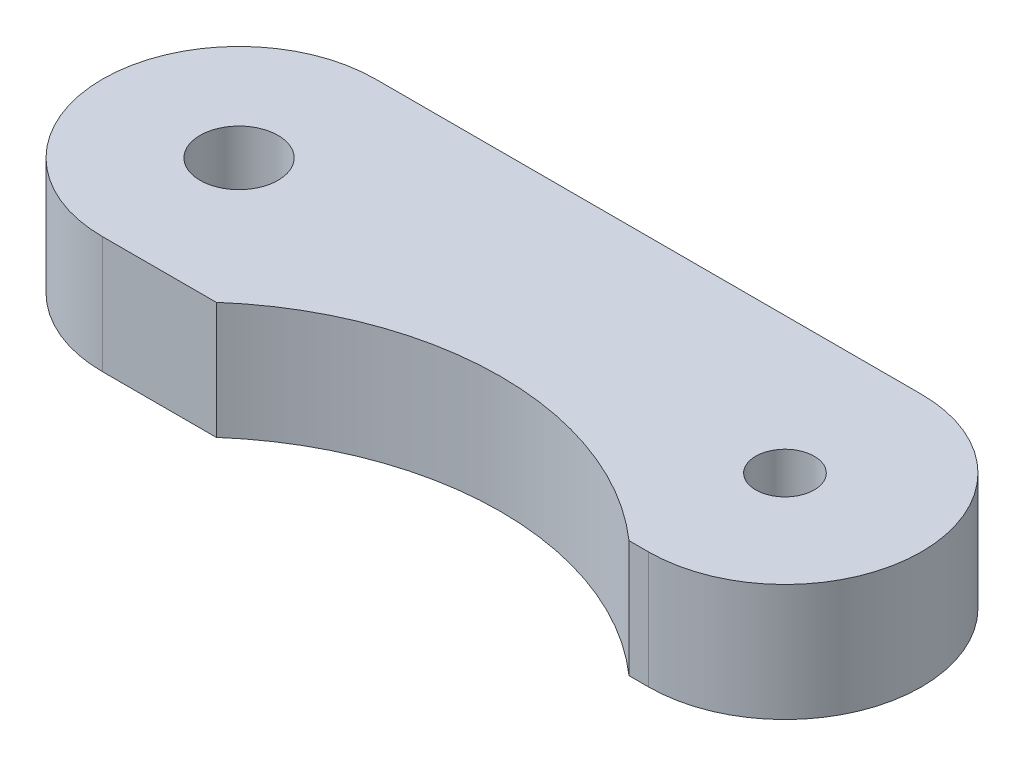
ISO-10303-21;
HEADER;
FILE_DESCRIPTION(('STEP AP214'),'2;1');
FILE_NAME('part.step','',(''),(''),'','','');
FILE_SCHEMA(('AUTOMOTIVE_DESIGN { 1 0 10303 214 1 1 1 1 }'));
ENDSEC;
DATA;
#1=APPLICATION_CONTEXT('core data for automotive mechanical design processes');
#2=APPLICATION_PROTOCOL_DEFINITION('international standard','automotive_design',2000,#1);
#3=PRODUCT_CONTEXT('',#1,'mechanical');
#4=PRODUCT('Part','Part','',(#3));
#5=PRODUCT_RELATED_PRODUCT_CATEGORY('part','',(#4));
#6=PRODUCT_DEFINITION_FORMATION('','',#4);
#7=PRODUCT_DEFINITION_CONTEXT('part definition',#1,'design');
#8=PRODUCT_DEFINITION('design','',#6,#7);
#9=PRODUCT_DEFINITION_SHAPE('','',#8);
#10=(LENGTH_UNIT() NAMED_UNIT(*) SI_UNIT(.MILLI.,.METRE.));
#11=(NAMED_UNIT(*) PLANE_ANGLE_UNIT() SI_UNIT($,.RADIAN.));
#12=(NAMED_UNIT(*) SI_UNIT($,.STERADIAN.) SOLID_ANGLE_UNIT());
#13=UNCERTAINTY_MEASURE_WITH_UNIT(LENGTH_MEASURE(1.E-05),#10,'distance_accuracy_value','');
#14=(GEOMETRIC_REPRESENTATION_CONTEXT(3) GLOBAL_UNCERTAINTY_ASSIGNED_CONTEXT((#13)) GLOBAL_UNIT_ASSIGNED_CONTEXT((#10,
#11,#12)) REPRESENTATION_CONTEXT('',''));
#15=CARTESIAN_POINT('',(0.,0.,0.));
#16=DIRECTION('',(0.,0.,1.));
#17=DIRECTION('',(1.,0.,0.));
#18=AXIS2_PLACEMENT_3D('',#15,#16,#17);
#19=CARTESIAN_POINT('',(0.,3.,3.5));
#20=DIRECTION('',(0.,0.,-1.));
#21=DIRECTION('',(-1.,0.,0.));
#22=AXIS2_PLACEMENT_3D('',#19,#20,#21);
#23=PLANE('',#22);
#24=DIRECTION('',(1.,0.,0.));
#25=VECTOR('',#24,1.);
#26=CARTESIAN_POINT('',(0.,0.,3.5));
#27=LINE('',#26,#25);
#28=CARTESIAN_POINT('',(0.,0.,3.5));
#29=VERTEX_POINT('',#28);
#30=CARTESIAN_POINT('',(2.91699475574164,0.,3.5));
#31=VERTEX_POINT('',#30);
#32=EDGE_CURVE('E107',#29,#31,#27,.T.);
#33=ORIENTED_EDGE('',*,*,#32,.T.);
#34=DIRECTION('',(0.,1.,0.));
#35=VECTOR('',#34,1.);
#36=CARTESIAN_POINT('',(2.91699475574164,-7.,3.5));
#37=LINE('',#36,#35);
#38=CARTESIAN_POINT('',(2.91699475574164,3.,3.5));
#39=VERTEX_POINT('',#38);
#40=EDGE_CURVE('E11',#31,#39,#37,.T.);
#41=ORIENTED_EDGE('',*,*,#40,.T.);
#42=DIRECTION('',(1.,0.,0.));
#43=VECTOR('',#42,1.);
#44=CARTESIAN_POINT('',(0.,3.,3.5));
#45=LINE('',#44,#43);
#46=CARTESIAN_POINT('',(0.,3.,3.5));
#47=VERTEX_POINT('',#46);
#48=EDGE_CURVE('E92',#47,#39,#45,.T.);
#49=ORIENTED_EDGE('',*,*,#48,.F.);
#50=DIRECTION('',(0.,-1.,0.));
#51=VECTOR('',#50,1.);
#52=CARTESIAN_POINT('',(0.,3.,3.5));
#53=LINE('',#52,#51);
#54=EDGE_CURVE('E148',#47,#29,#53,.T.);
#55=ORIENTED_EDGE('',*,*,#54,.T.);
#56=EDGE_LOOP('',(#33,#41,#49,#55));
#57=FACE_BOUND('',#56,.T.);
#58=ADVANCED_FACE('F39',(#57),#23,.F.);
#59=CARTESIAN_POINT('',(0.,3.,0.));
#60=DIRECTION('',(0.,1.,0.));
#61=DIRECTION('',(0.,0.,1.));
#62=AXIS2_PLACEMENT_3D('',#59,#60,#61);
#63=PLANE('',#62);
#64=CARTESIAN_POINT('',(8.20849737787082,3.,9.5));
#65=DIRECTION('',(0.,1.,0.));
#66=DIRECTION('',(0.,0.,-1.));
#67=AXIS2_PLACEMENT_3D('',#64,#65,#66);
#68=CIRCLE('',#67,8.);
#69=CARTESIAN_POINT('',(13.5,3.,3.5));
#70=VERTEX_POINT('',#69);
#71=EDGE_CURVE('E101',#70,#39,#68,.T.);
#72=ORIENTED_EDGE('',*,*,#71,.F.);
#73=CARTESIAN_POINT('',(14.,3.,3.5));
#74=VERTEX_POINT('',#73);
#75=EDGE_CURVE('E115',#70,#74,#45,.T.);
#76=ORIENTED_EDGE('',*,*,#75,.T.);
#77=CARTESIAN_POINT('',(14.,3.,0.));
#78=DIRECTION('',(0.,1.,0.));
#79=DIRECTION('',(0.,0.,1.));
#80=AXIS2_PLACEMENT_3D('',#77,#78,#79);
#81=CIRCLE('',#80,3.5);
#82=CARTESIAN_POINT('',(14.,3.,-3.5));
#83=VERTEX_POINT('',#82);
#84=EDGE_CURVE('E114',#74,#83,#81,.T.);
#85=ORIENTED_EDGE('',*,*,#84,.T.);
#86=DIRECTION('',(-1.,0.,0.));
#87=VECTOR('',#86,1.);
#88=CARTESIAN_POINT('',(0.,3.,-3.5));
#89=LINE('',#88,#87);
#90=CARTESIAN_POINT('',(0.,3.,-3.5));
#91=VERTEX_POINT('',#90);
#92=EDGE_CURVE('E64',#83,#91,#89,.T.);
#93=ORIENTED_EDGE('',*,*,#92,.T.);
#94=CARTESIAN_POINT('',(0.,3.,0.));
#95=DIRECTION('',(0.,1.,0.));
#96=DIRECTION('',(0.,0.,1.));
#97=AXIS2_PLACEMENT_3D('',#94,#95,#96);
#98=CIRCLE('',#97,3.5);
#99=EDGE_CURVE('E111',#91,#47,#98,.T.);
#100=ORIENTED_EDGE('',*,*,#99,.T.);
#101=ORIENTED_EDGE('',*,*,#48,.T.);
#102=EDGE_LOOP('',(#72,#76,#85,#93,#100,#101));
#103=FACE_BOUND('',#102,.T.);
#104=CARTESIAN_POINT('',(14.,3.,0.));
#105=DIRECTION('',(0.,1.,0.));
#106=DIRECTION('',(0.,0.,1.));
#107=AXIS2_PLACEMENT_3D('',#104,#105,#106);
#108=CIRCLE('',#107,0.75);
#109=CARTESIAN_POINT('',(14.,3.,0.75));
#110=VERTEX_POINT('',#109);
#111=EDGE_CURVE('E131',#110,#110,#108,.T.);
#112=ORIENTED_EDGE('',*,*,#111,.F.);
#113=EDGE_LOOP('',(#112));
#114=FACE_BOUND('',#113,.T.);
#115=CARTESIAN_POINT('',(0.,3.,0.));
#116=DIRECTION('',(0.,1.,0.));
#117=DIRECTION('',(0.,0.,1.));
#118=AXIS2_PLACEMENT_3D('',#115,#116,#117);
#119=CIRCLE('',#118,1.);
#120=CARTESIAN_POINT('',(0.,3.,1.));
#121=VERTEX_POINT('',#120);
#122=EDGE_CURVE('E167',#121,#121,#119,.T.);
#123=ORIENTED_EDGE('',*,*,#122,.F.);
#124=EDGE_LOOP('',(#123));
#125=FACE_BOUND('',#124,.T.);
#126=ADVANCED_FACE('F108',(#103,#114,#125),#63,.T.);
#127=CARTESIAN_POINT('',(0.,0.,0.));
#128=DIRECTION('',(0.,1.,0.));
#129=DIRECTION('',(0.,0.,1.));
#130=AXIS2_PLACEMENT_3D('',#127,#128,#129);
#131=PLANE('',#130);
#132=CARTESIAN_POINT('',(13.5,0.,3.5));
#133=VERTEX_POINT('',#132);
#134=CARTESIAN_POINT('',(14.,0.,3.5));
#135=VERTEX_POINT('',#134);
#136=EDGE_CURVE('E130',#133,#135,#27,.T.);
#137=ORIENTED_EDGE('',*,*,#136,.F.);
#138=CARTESIAN_POINT('',(8.20849737787082,0.,9.5));
#139=DIRECTION('',(0.,1.,0.));
#140=DIRECTION('',(0.,0.,1.));
#141=AXIS2_PLACEMENT_3D('',#138,#139,#140);
#142=CIRCLE('',#141,8.);
#143=EDGE_CURVE('E55',#133,#31,#142,.T.);
#144=ORIENTED_EDGE('',*,*,#143,.T.);
#145=ORIENTED_EDGE('',*,*,#32,.F.);
#146=CARTESIAN_POINT('',(0.,0.,0.));
#147=DIRECTION('',(0.,1.,0.));
#148=DIRECTION('',(0.,0.,1.));
#149=AXIS2_PLACEMENT_3D('',#146,#147,#148);
#150=CIRCLE('',#149,3.5);
#151=CARTESIAN_POINT('',(0.,0.,-3.5));
#152=VERTEX_POINT('',#151);
#153=EDGE_CURVE('E126',#152,#29,#150,.T.);
#154=ORIENTED_EDGE('',*,*,#153,.F.);
#155=DIRECTION('',(-1.,0.,0.));
#156=VECTOR('',#155,1.);
#157=CARTESIAN_POINT('',(0.,0.,-3.5));
#158=LINE('',#157,#156);
#159=CARTESIAN_POINT('',(14.,0.,-3.5));
#160=VERTEX_POINT('',#159);
#161=EDGE_CURVE('E85',#160,#152,#158,.T.);
#162=ORIENTED_EDGE('',*,*,#161,.F.);
#163=CARTESIAN_POINT('',(14.,0.,0.));
#164=DIRECTION('',(0.,1.,0.));
#165=DIRECTION('',(0.,0.,1.));
#166=AXIS2_PLACEMENT_3D('',#163,#164,#165);
#167=CIRCLE('',#166,3.5);
#168=EDGE_CURVE('E134',#135,#160,#167,.T.);
#169=ORIENTED_EDGE('',*,*,#168,.F.);
#170=EDGE_LOOP('',(#137,#144,#145,#154,#162,#169));
#171=FACE_BOUND('',#170,.T.);
#172=CARTESIAN_POINT('',(14.,0.,0.));
#173=DIRECTION('',(0.,1.,0.));
#174=DIRECTION('',(0.,0.,1.));
#175=AXIS2_PLACEMENT_3D('',#172,#173,#174);
#176=CIRCLE('',#175,0.75);
#177=CARTESIAN_POINT('',(14.,0.,0.75));
#178=VERTEX_POINT('',#177);
#179=EDGE_CURVE('E163',#178,#178,#176,.T.);
#180=ORIENTED_EDGE('',*,*,#179,.T.);
#181=EDGE_LOOP('',(#180));
#182=FACE_BOUND('',#181,.T.);
#183=CARTESIAN_POINT('',(0.,0.,0.));
#184=DIRECTION('',(0.,1.,0.));
#185=DIRECTION('',(0.,0.,1.));
#186=AXIS2_PLACEMENT_3D('',#183,#184,#185);
#187=CIRCLE('',#186,1.);
#188=CARTESIAN_POINT('',(0.,0.,1.));
#189=VERTEX_POINT('',#188);
#190=EDGE_CURVE('E170',#189,#189,#187,.T.);
#191=ORIENTED_EDGE('',*,*,#190,.T.);
#192=EDGE_LOOP('',(#191));
#193=FACE_BOUND('',#192,.T.);
#194=ADVANCED_FACE('F157',(#171,#182,#193),#131,.F.);
#195=CARTESIAN_POINT('',(0.,3.,0.));
#196=DIRECTION('',(0.,-1.,0.));
#197=DIRECTION('',(0.,0.,-1.));
#198=AXIS2_PLACEMENT_3D('',#195,#196,#197);
#199=CYLINDRICAL_SURFACE('',#198,3.5);
#200=ORIENTED_EDGE('',*,*,#153,.T.);
#201=ORIENTED_EDGE('',*,*,#54,.F.);
#202=ORIENTED_EDGE('',*,*,#99,.F.);
#203=DIRECTION('',(0.,-1.,0.));
#204=VECTOR('',#203,1.);
#205=CARTESIAN_POINT('',(0.,3.,-3.5));
#206=LINE('',#205,#204);
#207=EDGE_CURVE('E125',#91,#152,#206,.T.);
#208=ORIENTED_EDGE('',*,*,#207,.T.);
#209=EDGE_LOOP('',(#200,#201,#202,#208));
#210=FACE_BOUND('',#209,.T.);
#211=ADVANCED_FACE('F41',(#210),#199,.T.);
#212=ORIENTED_EDGE('',*,*,#75,.F.);
#213=DIRECTION('',(0.,1.,0.));
#214=VECTOR('',#213,1.);
#215=CARTESIAN_POINT('',(13.5,-7.,3.5));
#216=LINE('',#215,#214);
#217=EDGE_CURVE('E48',#70,#133,#216,.F.);
#218=ORIENTED_EDGE('',*,*,#217,.T.);
#219=ORIENTED_EDGE('',*,*,#136,.T.);
#220=DIRECTION('',(0.,-1.,0.));
#221=VECTOR('',#220,1.);
#222=CARTESIAN_POINT('',(14.,3.,3.5));
#223=LINE('',#222,#221);
#224=EDGE_CURVE('E144',#74,#135,#223,.T.);
#225=ORIENTED_EDGE('',*,*,#224,.F.);
#226=EDGE_LOOP('',(#212,#218,#219,#225));
#227=FACE_BOUND('',#226,.T.);
#228=ADVANCED_FACE('F153',(#227),#23,.F.);
#229=CARTESIAN_POINT('',(14.,3.,0.));
#230=DIRECTION('',(0.,-1.,0.));
#231=DIRECTION('',(0.,0.,-1.));
#232=AXIS2_PLACEMENT_3D('',#229,#230,#231);
#233=CYLINDRICAL_SURFACE('',#232,3.5);
#234=ORIENTED_EDGE('',*,*,#168,.T.);
#235=DIRECTION('',(0.,-1.,0.));
#236=VECTOR('',#235,1.);
#237=CARTESIAN_POINT('',(14.,3.,-3.5));
#238=LINE('',#237,#236);
#239=EDGE_CURVE('E141',#83,#160,#238,.T.);
#240=ORIENTED_EDGE('',*,*,#239,.F.);
#241=ORIENTED_EDGE('',*,*,#84,.F.);
#242=ORIENTED_EDGE('',*,*,#224,.T.);
#243=EDGE_LOOP('',(#234,#240,#241,#242));
#244=FACE_BOUND('',#243,.T.);
#245=ADVANCED_FACE('F199',(#244),#233,.T.);
#246=CARTESIAN_POINT('',(0.,3.,-3.5));
#247=DIRECTION('',(0.,0.,1.));
#248=DIRECTION('',(1.,0.,0.));
#249=AXIS2_PLACEMENT_3D('',#246,#247,#248);
#250=PLANE('',#249);
#251=ORIENTED_EDGE('',*,*,#161,.T.);
#252=ORIENTED_EDGE('',*,*,#207,.F.);
#253=ORIENTED_EDGE('',*,*,#92,.F.);
#254=ORIENTED_EDGE('',*,*,#239,.T.);
#255=EDGE_LOOP('',(#251,#252,#253,#254));
#256=FACE_BOUND('',#255,.T.);
#257=ADVANCED_FACE('F189',(#256),#250,.F.);
#258=CARTESIAN_POINT('',(14.,3.,0.));
#259=DIRECTION('',(0.,-1.,0.));
#260=DIRECTION('',(0.,0.,-1.));
#261=AXIS2_PLACEMENT_3D('',#258,#259,#260);
#262=CYLINDRICAL_SURFACE('',#261,0.75);
#263=ORIENTED_EDGE('',*,*,#111,.T.);
#264=EDGE_LOOP('',(#263));
#265=FACE_BOUND('',#264,.T.);
#266=ORIENTED_EDGE('',*,*,#179,.F.);
#267=EDGE_LOOP('',(#266));
#268=FACE_BOUND('',#267,.T.);
#269=ADVANCED_FACE('F181',(#265,#268),#262,.F.);
#270=CARTESIAN_POINT('',(0.,3.,0.));
#271=DIRECTION('',(0.,-1.,0.));
#272=DIRECTION('',(0.,0.,-1.));
#273=AXIS2_PLACEMENT_3D('',#270,#271,#272);
#274=CYLINDRICAL_SURFACE('',#273,1.);
#275=ORIENTED_EDGE('',*,*,#122,.T.);
#276=EDGE_LOOP('',(#275));
#277=FACE_BOUND('',#276,.T.);
#278=ORIENTED_EDGE('',*,*,#190,.F.);
#279=EDGE_LOOP('',(#278));
#280=FACE_BOUND('',#279,.T.);
#281=ADVANCED_FACE('F179',(#277,#280),#274,.F.);
#282=CARTESIAN_POINT('',(8.20849737787082,-7.,9.5));
#283=DIRECTION('',(0.,1.,0.));
#284=DIRECTION('',(0.,0.,1.));
#285=AXIS2_PLACEMENT_3D('',#282,#283,#284);
#286=CYLINDRICAL_SURFACE('',#285,8.);
#287=ORIENTED_EDGE('',*,*,#217,.F.);
#288=ORIENTED_EDGE('',*,*,#71,.T.);
#289=ORIENTED_EDGE('',*,*,#40,.F.);
#290=ORIENTED_EDGE('',*,*,#143,.F.);
#291=EDGE_LOOP('',(#287,#288,#289,#290));
#292=FACE_BOUND('',#291,.T.);
#293=ADVANCED_FACE('F102',(#292),#286,.F.);
#294=CLOSED_SHELL('',(#58,#126,#194,#211,#228,#245,#257,#269,#281,#293));
#295=MANIFOLD_SOLID_BREP('B2',#294);
#296=ADVANCED_BREP_SHAPE_REPRESENTATION('',(#18,#295),#14);
#297=SHAPE_DEFINITION_REPRESENTATION(#9,#296);
ENDSEC;
END-ISO-10303-21;
